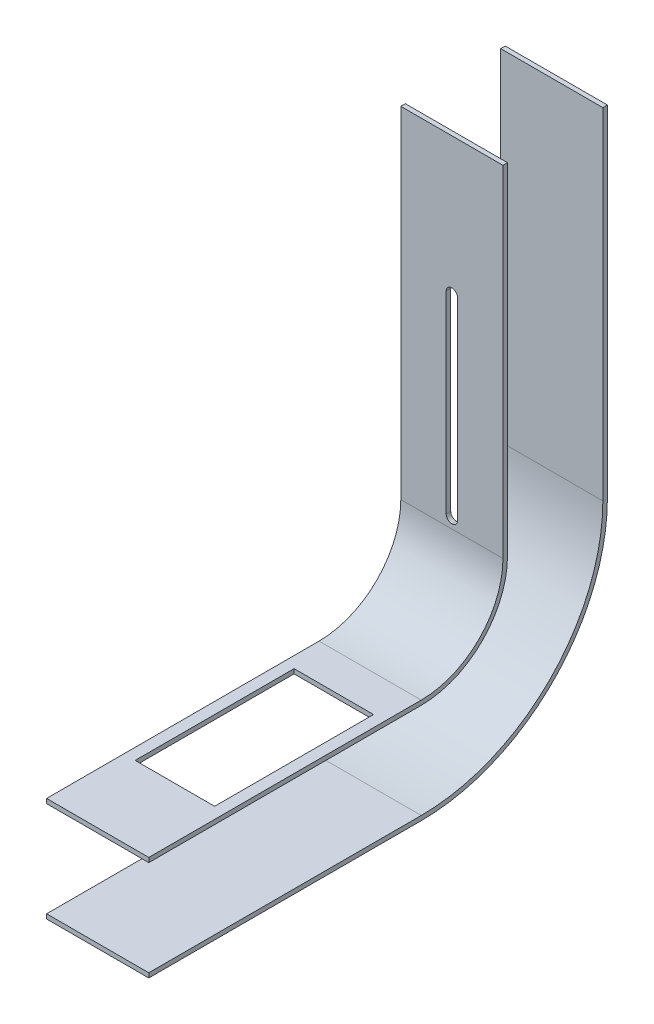
ISO-10303-21;
HEADER;
FILE_DESCRIPTION(('STEP AP214'),'2;1');
FILE_NAME('part.step','',(''),(''),'','','');
FILE_SCHEMA(('AUTOMOTIVE_DESIGN { 1 0 10303 214 1 1 1 1 }'));
ENDSEC;
DATA;
#1=APPLICATION_CONTEXT('core data for automotive mechanical design processes');
#2=APPLICATION_PROTOCOL_DEFINITION('international standard','automotive_design',2000,#1);
#3=PRODUCT_CONTEXT('',#1,'mechanical');
#4=PRODUCT('Part','Part','',(#3));
#5=PRODUCT_RELATED_PRODUCT_CATEGORY('part','',(#4));
#6=PRODUCT_DEFINITION_FORMATION('','',#4);
#7=PRODUCT_DEFINITION_CONTEXT('part definition',#1,'design');
#8=PRODUCT_DEFINITION('design','',#6,#7);
#9=PRODUCT_DEFINITION_SHAPE('','',#8);
#10=(LENGTH_UNIT() NAMED_UNIT(*) SI_UNIT(.MILLI.,.METRE.));
#11=(NAMED_UNIT(*) PLANE_ANGLE_UNIT() SI_UNIT($,.RADIAN.));
#12=(NAMED_UNIT(*) SI_UNIT($,.STERADIAN.) SOLID_ANGLE_UNIT());
#13=UNCERTAINTY_MEASURE_WITH_UNIT(LENGTH_MEASURE(1.E-05),#10,'distance_accuracy_value','');
#14=(GEOMETRIC_REPRESENTATION_CONTEXT(3) GLOBAL_UNCERTAINTY_ASSIGNED_CONTEXT((#13)) GLOBAL_UNIT_ASSIGNED_CONTEXT((#10,
#11,#12)) REPRESENTATION_CONTEXT('',''));
#15=CARTESIAN_POINT('',(0.,0.,0.));
#16=DIRECTION('',(0.,0.,1.));
#17=DIRECTION('',(1.,0.,0.));
#18=AXIS2_PLACEMENT_3D('',#15,#16,#17);
#19=CARTESIAN_POINT('',(45.,-82.,0.));
#20=DIRECTION('',(0.,1.,0.));
#21=DIRECTION('',(0.,0.,1.));
#22=AXIS2_PLACEMENT_3D('',#19,#20,#21);
#23=PLANE('',#22);
#24=DIRECTION('',(0.,0.,-1.));
#25=VECTOR('',#24,1.);
#26=CARTESIAN_POINT('',(0.,-82.,0.));
#27=LINE('',#26,#25);
#28=CARTESIAN_POINT('',(0.,-82.,120.));
#29=VERTEX_POINT('',#28);
#30=CARTESIAN_POINT('',(0.,-82.,0.));
#31=VERTEX_POINT('',#30);
#32=EDGE_CURVE('E189',#29,#31,#27,.T.);
#33=ORIENTED_EDGE('',*,*,#32,.T.);
#34=DIRECTION('',(-1.,0.,0.));
#35=VECTOR('',#34,1.);
#36=CARTESIAN_POINT('',(45.,-82.,0.));
#37=LINE('',#36,#35);
#38=CARTESIAN_POINT('',(45.,-82.,0.));
#39=VERTEX_POINT('',#38);
#40=EDGE_CURVE('E13',#39,#31,#37,.T.);
#41=ORIENTED_EDGE('',*,*,#40,.F.);
#42=DIRECTION('',(0.,0.,-1.));
#43=VECTOR('',#42,1.);
#44=CARTESIAN_POINT('',(45.,-82.,0.));
#45=LINE('',#44,#43);
#46=CARTESIAN_POINT('',(45.,-82.,120.));
#47=VERTEX_POINT('',#46);
#48=EDGE_CURVE('E207',#47,#39,#45,.T.);
#49=ORIENTED_EDGE('',*,*,#48,.F.);
#50=DIRECTION('',(-1.,0.,0.));
#51=VECTOR('',#50,1.);
#52=CARTESIAN_POINT('',(45.,-82.,120.));
#53=LINE('',#52,#51);
#54=EDGE_CURVE('E185',#47,#29,#53,.T.);
#55=ORIENTED_EDGE('',*,*,#54,.T.);
#56=EDGE_LOOP('',(#33,#41,#49,#55));
#57=FACE_BOUND('',#56,.T.);
#58=ADVANCED_FACE('F94',(#57),#23,.F.);
#59=CARTESIAN_POINT('',(45.,0.,0.));
#60=DIRECTION('',(-1.,0.,0.));
#61=DIRECTION('',(0.,0.,1.));
#62=AXIS2_PLACEMENT_3D('',#59,#60,#61);
#63=CYLINDRICAL_SURFACE('',#62,82.);
#64=CARTESIAN_POINT('',(0.,0.,0.));
#65=DIRECTION('',(1.,0.,0.));
#66=DIRECTION('',(0.,0.,-1.));
#67=AXIS2_PLACEMENT_3D('',#64,#65,#66);
#68=CIRCLE('',#67,82.);
#69=CARTESIAN_POINT('',(0.,0.,-82.));
#70=VERTEX_POINT('',#69);
#71=EDGE_CURVE('E192',#31,#70,#68,.T.);
#72=ORIENTED_EDGE('',*,*,#71,.T.);
#73=DIRECTION('',(-1.,0.,0.));
#74=VECTOR('',#73,1.);
#75=CARTESIAN_POINT('',(45.,0.,-82.));
#76=LINE('',#75,#74);
#77=CARTESIAN_POINT('',(45.,0.,-82.));
#78=VERTEX_POINT('',#77);
#79=EDGE_CURVE('E102',#78,#70,#76,.T.);
#80=ORIENTED_EDGE('',*,*,#79,.F.);
#81=CARTESIAN_POINT('',(45.,0.,0.));
#82=DIRECTION('',(1.,0.,0.));
#83=DIRECTION('',(0.,0.,-1.));
#84=AXIS2_PLACEMENT_3D('',#81,#82,#83);
#85=CIRCLE('',#84,82.);
#86=EDGE_CURVE('E149',#39,#78,#85,.T.);
#87=ORIENTED_EDGE('',*,*,#86,.F.);
#88=ORIENTED_EDGE('',*,*,#40,.T.);
#89=EDGE_LOOP('',(#72,#80,#87,#88));
#90=FACE_BOUND('',#89,.T.);
#91=ADVANCED_FACE('F237',(#90),#63,.T.);
#92=CARTESIAN_POINT('',(45.,0.,-82.));
#93=DIRECTION('',(0.,0.,1.));
#94=DIRECTION('',(1.,0.,0.));
#95=AXIS2_PLACEMENT_3D('',#92,#93,#94);
#96=PLANE('',#95);
#97=DIRECTION('',(0.,1.,0.));
#98=VECTOR('',#97,1.);
#99=CARTESIAN_POINT('',(0.,0.,-82.));
#100=LINE('',#99,#98);
#101=CARTESIAN_POINT('',(0.,150.,-82.));
#102=VERTEX_POINT('',#101);
#103=EDGE_CURVE('E194',#70,#102,#100,.T.);
#104=ORIENTED_EDGE('',*,*,#103,.T.);
#105=DIRECTION('',(-1.,0.,0.));
#106=VECTOR('',#105,1.);
#107=CARTESIAN_POINT('',(45.,150.,-82.));
#108=LINE('',#107,#106);
#109=CARTESIAN_POINT('',(45.,150.,-82.));
#110=VERTEX_POINT('',#109);
#111=EDGE_CURVE('E213',#110,#102,#108,.T.);
#112=ORIENTED_EDGE('',*,*,#111,.F.);
#113=DIRECTION('',(0.,1.,0.));
#114=VECTOR('',#113,1.);
#115=CARTESIAN_POINT('',(45.,0.,-82.));
#116=LINE('',#115,#114);
#117=EDGE_CURVE('E220',#78,#110,#116,.T.);
#118=ORIENTED_EDGE('',*,*,#117,.F.);
#119=ORIENTED_EDGE('',*,*,#79,.T.);
#120=EDGE_LOOP('',(#104,#112,#118,#119));
#121=FACE_BOUND('',#120,.T.);
#122=ADVANCED_FACE('F218',(#121),#96,.F.);
#123=CARTESIAN_POINT('',(45.,150.,0.));
#124=DIRECTION('',(0.,1.,0.));
#125=DIRECTION('',(0.,0.,1.));
#126=AXIS2_PLACEMENT_3D('',#123,#124,#125);
#127=PLANE('',#126);
#128=DIRECTION('',(0.,0.,-1.));
#129=VECTOR('',#128,1.);
#130=CARTESIAN_POINT('',(0.,150.,0.));
#131=LINE('',#130,#129);
#132=CARTESIAN_POINT('',(0.,150.,-80.));
#133=VERTEX_POINT('',#132);
#134=EDGE_CURVE('E197',#133,#102,#131,.T.);
#135=ORIENTED_EDGE('',*,*,#134,.F.);
#136=DIRECTION('',(-1.,0.,0.));
#137=VECTOR('',#136,1.);
#138=CARTESIAN_POINT('',(45.,150.,-80.));
#139=LINE('',#138,#137);
#140=CARTESIAN_POINT('',(45.,150.,-80.));
#141=VERTEX_POINT('',#140);
#142=EDGE_CURVE('E211',#141,#133,#139,.T.);
#143=ORIENTED_EDGE('',*,*,#142,.F.);
#144=DIRECTION('',(0.,0.,-1.));
#145=VECTOR('',#144,1.);
#146=CARTESIAN_POINT('',(45.,150.,0.));
#147=LINE('',#146,#145);
#148=EDGE_CURVE('E229',#141,#110,#147,.T.);
#149=ORIENTED_EDGE('',*,*,#148,.T.);
#150=ORIENTED_EDGE('',*,*,#111,.T.);
#151=EDGE_LOOP('',(#135,#143,#149,#150));
#152=FACE_BOUND('',#151,.T.);
#153=ADVANCED_FACE('F227',(#152),#127,.T.);
#154=CARTESIAN_POINT('',(45.,0.,-80.));
#155=DIRECTION('',(0.,0.,1.));
#156=DIRECTION('',(1.,0.,0.));
#157=AXIS2_PLACEMENT_3D('',#154,#155,#156);
#158=PLANE('',#157);
#159=DIRECTION('',(0.,1.,0.));
#160=VECTOR('',#159,1.);
#161=CARTESIAN_POINT('',(0.,0.,-80.));
#162=LINE('',#161,#160);
#163=CARTESIAN_POINT('',(0.,0.,-80.));
#164=VERTEX_POINT('',#163);
#165=EDGE_CURVE('E200',#164,#133,#162,.T.);
#166=ORIENTED_EDGE('',*,*,#165,.F.);
#167=DIRECTION('',(-1.,0.,0.));
#168=VECTOR('',#167,1.);
#169=CARTESIAN_POINT('',(45.,0.,-80.));
#170=LINE('',#169,#168);
#171=CARTESIAN_POINT('',(45.,0.,-80.));
#172=VERTEX_POINT('',#171);
#173=EDGE_CURVE('E174',#172,#164,#170,.T.);
#174=ORIENTED_EDGE('',*,*,#173,.F.);
#175=DIRECTION('',(0.,1.,0.));
#176=VECTOR('',#175,1.);
#177=CARTESIAN_POINT('',(45.,0.,-80.));
#178=LINE('',#177,#176);
#179=EDGE_CURVE('E181',#172,#141,#178,.T.);
#180=ORIENTED_EDGE('',*,*,#179,.T.);
#181=ORIENTED_EDGE('',*,*,#142,.T.);
#182=EDGE_LOOP('',(#166,#174,#180,#181));
#183=FACE_BOUND('',#182,.T.);
#184=ADVANCED_FACE('F247',(#183),#158,.T.);
#185=CARTESIAN_POINT('',(45.,0.,0.));
#186=DIRECTION('',(-1.,0.,0.));
#187=DIRECTION('',(0.,0.,1.));
#188=AXIS2_PLACEMENT_3D('',#185,#186,#187);
#189=CYLINDRICAL_SURFACE('',#188,80.);
#190=CARTESIAN_POINT('',(0.,0.,0.));
#191=DIRECTION('',(1.,0.,0.));
#192=DIRECTION('',(0.,0.,-1.));
#193=AXIS2_PLACEMENT_3D('',#190,#191,#192);
#194=CIRCLE('',#193,80.);
#195=CARTESIAN_POINT('',(0.,-80.,0.));
#196=VERTEX_POINT('',#195);
#197=EDGE_CURVE('E169',#196,#164,#194,.T.);
#198=ORIENTED_EDGE('',*,*,#197,.F.);
#199=DIRECTION('',(-1.,0.,0.));
#200=VECTOR('',#199,1.);
#201=CARTESIAN_POINT('',(45.,-80.,0.));
#202=LINE('',#201,#200);
#203=CARTESIAN_POINT('',(45.,-80.,0.));
#204=VERTEX_POINT('',#203);
#205=EDGE_CURVE('E164',#204,#196,#202,.T.);
#206=ORIENTED_EDGE('',*,*,#205,.F.);
#207=CARTESIAN_POINT('',(45.,0.,0.));
#208=DIRECTION('',(1.,0.,0.));
#209=DIRECTION('',(0.,0.,-1.));
#210=AXIS2_PLACEMENT_3D('',#207,#208,#209);
#211=CIRCLE('',#210,80.);
#212=EDGE_CURVE('E167',#204,#172,#211,.T.);
#213=ORIENTED_EDGE('',*,*,#212,.T.);
#214=ORIENTED_EDGE('',*,*,#173,.T.);
#215=EDGE_LOOP('',(#198,#206,#213,#214));
#216=FACE_BOUND('',#215,.T.);
#217=ADVANCED_FACE('F166',(#216),#189,.F.);
#218=CARTESIAN_POINT('',(45.,-80.,0.));
#219=DIRECTION('',(0.,1.,0.));
#220=DIRECTION('',(0.,0.,1.));
#221=AXIS2_PLACEMENT_3D('',#218,#219,#220);
#222=PLANE('',#221);
#223=DIRECTION('',(0.,0.,-1.));
#224=VECTOR('',#223,1.);
#225=CARTESIAN_POINT('',(0.,-80.,0.));
#226=LINE('',#225,#224);
#227=CARTESIAN_POINT('',(0.,-80.,120.));
#228=VERTEX_POINT('',#227);
#229=EDGE_CURVE('E204',#228,#196,#226,.T.);
#230=ORIENTED_EDGE('',*,*,#229,.F.);
#231=DIRECTION('',(-1.,0.,0.));
#232=VECTOR('',#231,1.);
#233=CARTESIAN_POINT('',(45.,-80.,120.));
#234=LINE('',#233,#232);
#235=CARTESIAN_POINT('',(45.,-80.,120.));
#236=VERTEX_POINT('',#235);
#237=EDGE_CURVE('E138',#236,#228,#234,.T.);
#238=ORIENTED_EDGE('',*,*,#237,.F.);
#239=DIRECTION('',(0.,0.,-1.));
#240=VECTOR('',#239,1.);
#241=CARTESIAN_POINT('',(45.,-80.,0.));
#242=LINE('',#241,#240);
#243=EDGE_CURVE('E178',#236,#204,#242,.T.);
#244=ORIENTED_EDGE('',*,*,#243,.T.);
#245=ORIENTED_EDGE('',*,*,#205,.T.);
#246=EDGE_LOOP('',(#230,#238,#244,#245));
#247=FACE_BOUND('',#246,.T.);
#248=ADVANCED_FACE('F183',(#247),#222,.T.);
#249=CARTESIAN_POINT('',(45.,0.,120.));
#250=DIRECTION('',(0.,0.,-1.));
#251=DIRECTION('',(-1.,0.,0.));
#252=AXIS2_PLACEMENT_3D('',#249,#250,#251);
#253=PLANE('',#252);
#254=DIRECTION('',(0.,-1.,0.));
#255=VECTOR('',#254,1.);
#256=CARTESIAN_POINT('',(0.,0.,120.));
#257=LINE('',#256,#255);
#258=EDGE_CURVE('E141',#228,#29,#257,.T.);
#259=ORIENTED_EDGE('',*,*,#258,.T.);
#260=ORIENTED_EDGE('',*,*,#54,.F.);
#261=DIRECTION('',(0.,-1.,0.));
#262=VECTOR('',#261,1.);
#263=CARTESIAN_POINT('',(45.,0.,120.));
#264=LINE('',#263,#262);
#265=EDGE_CURVE('E110',#236,#47,#264,.T.);
#266=ORIENTED_EDGE('',*,*,#265,.F.);
#267=ORIENTED_EDGE('',*,*,#237,.T.);
#268=EDGE_LOOP('',(#259,#260,#266,#267));
#269=FACE_BOUND('',#268,.T.);
#270=ADVANCED_FACE('F255',(#269),#253,.F.);
#271=CARTESIAN_POINT('',(45.,0.,0.));
#272=DIRECTION('',(1.,0.,0.));
#273=DIRECTION('',(0.,0.,-1.));
#274=AXIS2_PLACEMENT_3D('',#271,#272,#273);
#275=PLANE('',#274);
#276=ORIENTED_EDGE('',*,*,#48,.T.);
#277=ORIENTED_EDGE('',*,*,#86,.T.);
#278=ORIENTED_EDGE('',*,*,#117,.T.);
#279=ORIENTED_EDGE('',*,*,#148,.F.);
#280=ORIENTED_EDGE('',*,*,#179,.F.);
#281=ORIENTED_EDGE('',*,*,#212,.F.);
#282=ORIENTED_EDGE('',*,*,#243,.F.);
#283=ORIENTED_EDGE('',*,*,#265,.T.);
#284=EDGE_LOOP('',(#276,#277,#278,#279,#280,#281,#282,#283));
#285=FACE_BOUND('',#284,.T.);
#286=ADVANCED_FACE('F177',(#285),#275,.T.);
#287=CARTESIAN_POINT('',(0.,0.,0.));
#288=DIRECTION('',(1.,0.,0.));
#289=DIRECTION('',(0.,0.,-1.));
#290=AXIS2_PLACEMENT_3D('',#287,#288,#289);
#291=PLANE('',#290);
#292=ORIENTED_EDGE('',*,*,#32,.F.);
#293=ORIENTED_EDGE('',*,*,#258,.F.);
#294=ORIENTED_EDGE('',*,*,#229,.T.);
#295=ORIENTED_EDGE('',*,*,#197,.T.);
#296=ORIENTED_EDGE('',*,*,#165,.T.);
#297=ORIENTED_EDGE('',*,*,#134,.T.);
#298=ORIENTED_EDGE('',*,*,#103,.F.);
#299=ORIENTED_EDGE('',*,*,#71,.F.);
#300=EDGE_LOOP('',(#292,#293,#294,#295,#296,#297,#298,#299));
#301=FACE_BOUND('',#300,.T.);
#302=ADVANCED_FACE('F223',(#301),#291,.F.);
#303=CLOSED_SHELL('',(#58,#91,#122,#153,#184,#217,#248,#270,#286,#302));
#304=MANIFOLD_SOLID_BREP('B2',#303);
#305=CARTESIAN_POINT('',(45.,0.,0.));
#306=DIRECTION('',(-1.,0.,0.));
#307=DIRECTION('',(0.,0.,1.));
#308=AXIS2_PLACEMENT_3D('',#305,#306,#307);
#309=CYLINDRICAL_SURFACE('',#308,36.);
#310=CARTESIAN_POINT('',(0.,0.,0.));
#311=DIRECTION('',(1.,0.,0.));
#312=DIRECTION('',(0.,0.,-1.));
#313=AXIS2_PLACEMENT_3D('',#310,#311,#312);
#314=CIRCLE('',#313,36.);
#315=CARTESIAN_POINT('',(0.,-36.,0.));
#316=VERTEX_POINT('',#315);
#317=CARTESIAN_POINT('',(0.,0.,-36.));
#318=VERTEX_POINT('',#317);
#319=EDGE_CURVE('E495',#316,#318,#314,.T.);
#320=ORIENTED_EDGE('',*,*,#319,.F.);
#321=DIRECTION('',(-1.,0.,0.));
#322=VECTOR('',#321,1.);
#323=CARTESIAN_POINT('',(45.,-36.,0.));
#324=LINE('',#323,#322);
#325=CARTESIAN_POINT('',(45.,-36.,0.));
#326=VERTEX_POINT('',#325);
#327=EDGE_CURVE('E553',#326,#316,#324,.T.);
#328=ORIENTED_EDGE('',*,*,#327,.F.);
#329=CARTESIAN_POINT('',(45.,0.,0.));
#330=DIRECTION('',(1.,0.,0.));
#331=DIRECTION('',(0.,0.,-1.));
#332=AXIS2_PLACEMENT_3D('',#329,#330,#331);
#333=CIRCLE('',#332,36.);
#334=CARTESIAN_POINT('',(45.,0.,-36.));
#335=VERTEX_POINT('',#334);
#336=EDGE_CURVE('E496',#326,#335,#333,.T.);
#337=ORIENTED_EDGE('',*,*,#336,.T.);
#338=DIRECTION('',(-1.,0.,0.));
#339=VECTOR('',#338,1.);
#340=CARTESIAN_POINT('',(45.,0.,-36.));
#341=LINE('',#340,#339);
#342=EDGE_CURVE('E517',#335,#318,#341,.T.);
#343=ORIENTED_EDGE('',*,*,#342,.T.);
#344=EDGE_LOOP('',(#320,#328,#337,#343));
#345=FACE_BOUND('',#344,.T.);
#346=ADVANCED_FACE('F322',(#345),#309,.F.);
#347=CARTESIAN_POINT('',(45.,-36.,0.));
#348=DIRECTION('',(0.,-1.,0.));
#349=DIRECTION('',(0.,0.,-1.));
#350=AXIS2_PLACEMENT_3D('',#347,#348,#349);
#351=PLANE('',#350);
#352=DIRECTION('',(-1.,0.,0.));
#353=VECTOR('',#352,1.);
#354=CARTESIAN_POINT('',(5.,-36.,16.));
#355=LINE('',#354,#353);
#356=CARTESIAN_POINT('',(40.,-36.,16.));
#357=VERTEX_POINT('',#356);
#358=CARTESIAN_POINT('',(5.,-36.,16.));
#359=VERTEX_POINT('',#358);
#360=EDGE_CURVE('E464',#357,#359,#355,.T.);
#361=ORIENTED_EDGE('',*,*,#360,.F.);
#362=DIRECTION('',(0.,0.,-1.));
#363=VECTOR('',#362,1.);
#364=CARTESIAN_POINT('',(40.,-36.,86.));
#365=LINE('',#364,#363);
#366=CARTESIAN_POINT('',(40.,-36.,86.));
#367=VERTEX_POINT('',#366);
#368=EDGE_CURVE('E469',#367,#357,#365,.T.);
#369=ORIENTED_EDGE('',*,*,#368,.F.);
#370=DIRECTION('',(1.,0.,0.));
#371=VECTOR('',#370,1.);
#372=CARTESIAN_POINT('',(5.,-36.,86.));
#373=LINE('',#372,#371);
#374=CARTESIAN_POINT('',(5.,-36.,86.));
#375=VERTEX_POINT('',#374);
#376=EDGE_CURVE('E474',#375,#367,#373,.T.);
#377=ORIENTED_EDGE('',*,*,#376,.F.);
#378=DIRECTION('',(0.,0.,1.));
#379=VECTOR('',#378,1.);
#380=CARTESIAN_POINT('',(5.,-36.,86.));
#381=LINE('',#380,#379);
#382=EDGE_CURVE('E453',#359,#375,#381,.T.);
#383=ORIENTED_EDGE('',*,*,#382,.F.);
#384=EDGE_LOOP('',(#361,#369,#377,#383));
#385=FACE_BOUND('',#384,.T.);
#386=DIRECTION('',(0.,0.,1.));
#387=VECTOR('',#386,1.);
#388=CARTESIAN_POINT('',(0.,-36.,0.));
#389=LINE('',#388,#387);
#390=CARTESIAN_POINT('',(0.,-36.,120.));
#391=VERTEX_POINT('',#390);
#392=EDGE_CURVE('E520',#316,#391,#389,.T.);
#393=ORIENTED_EDGE('',*,*,#392,.T.);
#394=DIRECTION('',(-1.,0.,0.));
#395=VECTOR('',#394,1.);
#396=CARTESIAN_POINT('',(45.,-36.,120.));
#397=LINE('',#396,#395);
#398=CARTESIAN_POINT('',(45.,-36.,120.));
#399=VERTEX_POINT('',#398);
#400=EDGE_CURVE('E550',#399,#391,#397,.T.);
#401=ORIENTED_EDGE('',*,*,#400,.F.);
#402=DIRECTION('',(0.,0.,1.));
#403=VECTOR('',#402,1.);
#404=CARTESIAN_POINT('',(45.,-36.,0.));
#405=LINE('',#404,#403);
#406=EDGE_CURVE('E499',#326,#399,#405,.T.);
#407=ORIENTED_EDGE('',*,*,#406,.F.);
#408=ORIENTED_EDGE('',*,*,#327,.T.);
#409=EDGE_LOOP('',(#393,#401,#407,#408));
#410=FACE_BOUND('',#409,.T.);
#411=ADVANCED_FACE('F471',(#385,#410),#351,.F.);
#412=CARTESIAN_POINT('',(45.,0.,120.));
#413=DIRECTION('',(0.,0.,-1.));
#414=DIRECTION('',(-1.,0.,0.));
#415=AXIS2_PLACEMENT_3D('',#412,#413,#414);
#416=PLANE('',#415);
#417=DIRECTION('',(0.,-1.,0.));
#418=VECTOR('',#417,1.);
#419=CARTESIAN_POINT('',(0.,0.,120.));
#420=LINE('',#419,#418);
#421=CARTESIAN_POINT('',(0.,-38.,120.));
#422=VERTEX_POINT('',#421);
#423=EDGE_CURVE('E522',#391,#422,#420,.T.);
#424=ORIENTED_EDGE('',*,*,#423,.T.);
#425=DIRECTION('',(-1.,0.,0.));
#426=VECTOR('',#425,1.);
#427=CARTESIAN_POINT('',(45.,-38.,120.));
#428=LINE('',#427,#426);
#429=CARTESIAN_POINT('',(45.,-38.,120.));
#430=VERTEX_POINT('',#429);
#431=EDGE_CURVE('E548',#430,#422,#428,.T.);
#432=ORIENTED_EDGE('',*,*,#431,.F.);
#433=DIRECTION('',(0.,-1.,0.));
#434=VECTOR('',#433,1.);
#435=CARTESIAN_POINT('',(45.,0.,120.));
#436=LINE('',#435,#434);
#437=EDGE_CURVE('E502',#399,#430,#436,.T.);
#438=ORIENTED_EDGE('',*,*,#437,.F.);
#439=ORIENTED_EDGE('',*,*,#400,.T.);
#440=EDGE_LOOP('',(#424,#432,#438,#439));
#441=FACE_BOUND('',#440,.T.);
#442=ADVANCED_FACE('F641',(#441),#416,.F.);
#443=CARTESIAN_POINT('',(45.,-38.,0.));
#444=DIRECTION('',(0.,-1.,0.));
#445=DIRECTION('',(0.,0.,-1.));
#446=AXIS2_PLACEMENT_3D('',#443,#444,#445);
#447=PLANE('',#446);
#448=DIRECTION('',(0.,0.,1.));
#449=VECTOR('',#448,1.);
#450=CARTESIAN_POINT('',(40.,-38.,0.));
#451=LINE('',#450,#449);
#452=CARTESIAN_POINT('',(40.,-38.,16.));
#453=VERTEX_POINT('',#452);
#454=CARTESIAN_POINT('',(40.,-38.,86.));
#455=VERTEX_POINT('',#454);
#456=EDGE_CURVE('E560',#453,#455,#451,.T.);
#457=ORIENTED_EDGE('',*,*,#456,.F.);
#458=DIRECTION('',(1.,0.,0.));
#459=VECTOR('',#458,1.);
#460=CARTESIAN_POINT('',(45.,-38.,16.));
#461=LINE('',#460,#459);
#462=CARTESIAN_POINT('',(5.,-38.,16.));
#463=VERTEX_POINT('',#462);
#464=EDGE_CURVE('E555',#463,#453,#461,.T.);
#465=ORIENTED_EDGE('',*,*,#464,.F.);
#466=DIRECTION('',(0.,0.,-1.));
#467=VECTOR('',#466,1.);
#468=CARTESIAN_POINT('',(5.,-38.,0.));
#469=LINE('',#468,#467);
#470=CARTESIAN_POINT('',(5.,-38.,86.));
#471=VERTEX_POINT('',#470);
#472=EDGE_CURVE('E456',#471,#463,#469,.T.);
#473=ORIENTED_EDGE('',*,*,#472,.F.);
#474=DIRECTION('',(-1.,0.,0.));
#475=VECTOR('',#474,1.);
#476=CARTESIAN_POINT('',(45.,-38.,86.));
#477=LINE('',#476,#475);
#478=EDGE_CURVE('E558',#455,#471,#477,.T.);
#479=ORIENTED_EDGE('',*,*,#478,.F.);
#480=EDGE_LOOP('',(#457,#465,#473,#479));
#481=FACE_BOUND('',#480,.T.);
#482=DIRECTION('',(0.,0.,1.));
#483=VECTOR('',#482,1.);
#484=CARTESIAN_POINT('',(0.,-38.,0.));
#485=LINE('',#484,#483);
#486=CARTESIAN_POINT('',(0.,-38.,0.));
#487=VERTEX_POINT('',#486);
#488=EDGE_CURVE('E525',#487,#422,#485,.T.);
#489=ORIENTED_EDGE('',*,*,#488,.F.);
#490=DIRECTION('',(-1.,0.,0.));
#491=VECTOR('',#490,1.);
#492=CARTESIAN_POINT('',(45.,-38.,0.));
#493=LINE('',#492,#491);
#494=CARTESIAN_POINT('',(45.,-38.,0.));
#495=VERTEX_POINT('',#494);
#496=EDGE_CURVE('E546',#495,#487,#493,.T.);
#497=ORIENTED_EDGE('',*,*,#496,.F.);
#498=DIRECTION('',(0.,0.,1.));
#499=VECTOR('',#498,1.);
#500=CARTESIAN_POINT('',(45.,-38.,0.));
#501=LINE('',#500,#499);
#502=EDGE_CURVE('E504',#495,#430,#501,.T.);
#503=ORIENTED_EDGE('',*,*,#502,.T.);
#504=ORIENTED_EDGE('',*,*,#431,.T.);
#505=EDGE_LOOP('',(#489,#497,#503,#504));
#506=FACE_BOUND('',#505,.T.);
#507=ADVANCED_FACE('F637',(#481,#506),#447,.T.);
#508=CARTESIAN_POINT('',(45.,0.,0.));
#509=DIRECTION('',(-1.,0.,0.));
#510=DIRECTION('',(0.,0.,1.));
#511=AXIS2_PLACEMENT_3D('',#508,#509,#510);
#512=CYLINDRICAL_SURFACE('',#511,38.);
#513=CARTESIAN_POINT('',(0.,0.,0.));
#514=DIRECTION('',(1.,0.,0.));
#515=DIRECTION('',(0.,0.,-1.));
#516=AXIS2_PLACEMENT_3D('',#513,#514,#515);
#517=CIRCLE('',#516,38.);
#518=CARTESIAN_POINT('',(0.,0.,-38.));
#519=VERTEX_POINT('',#518);
#520=EDGE_CURVE('E528',#487,#519,#517,.T.);
#521=ORIENTED_EDGE('',*,*,#520,.T.);
#522=DIRECTION('',(-1.,0.,0.));
#523=VECTOR('',#522,1.);
#524=CARTESIAN_POINT('',(45.,0.,-38.));
#525=LINE('',#524,#523);
#526=CARTESIAN_POINT('',(45.,0.,-38.));
#527=VERTEX_POINT('',#526);
#528=EDGE_CURVE('E544',#527,#519,#525,.T.);
#529=ORIENTED_EDGE('',*,*,#528,.F.);
#530=CARTESIAN_POINT('',(45.,0.,0.));
#531=DIRECTION('',(1.,0.,0.));
#532=DIRECTION('',(0.,0.,-1.));
#533=AXIS2_PLACEMENT_3D('',#530,#531,#532);
#534=CIRCLE('',#533,38.);
#535=EDGE_CURVE('E507',#495,#527,#534,.T.);
#536=ORIENTED_EDGE('',*,*,#535,.F.);
#537=ORIENTED_EDGE('',*,*,#496,.T.);
#538=EDGE_LOOP('',(#521,#529,#536,#537));
#539=FACE_BOUND('',#538,.T.);
#540=ADVANCED_FACE('F614',(#539),#512,.T.);
#541=CARTESIAN_POINT('',(45.,0.,-38.));
#542=DIRECTION('',(0.,0.,-1.));
#543=DIRECTION('',(0.,1.,0.));
#544=AXIS2_PLACEMENT_3D('',#541,#542,#543);
#545=PLANE('',#544);
#546=CARTESIAN_POINT('',(22.5,89.5,-38.));
#547=DIRECTION('',(0.,0.,-1.));
#548=DIRECTION('',(0.,1.,0.));
#549=AXIS2_PLACEMENT_3D('',#546,#547,#548);
#550=CIRCLE('',#549,2.5);
#551=CARTESIAN_POINT('',(25.,89.5,-38.));
#552=VERTEX_POINT('',#551);
#553=CARTESIAN_POINT('',(22.5,92.,-38.));
#554=VERTEX_POINT('',#553);
#555=EDGE_CURVE('E574',#552,#554,#550,.F.);
#556=ORIENTED_EDGE('',*,*,#555,.T.);
#557=CARTESIAN_POINT('',(22.5,89.5,-38.));
#558=DIRECTION('',(0.,0.,-1.));
#559=DIRECTION('',(0.,1.,0.));
#560=AXIS2_PLACEMENT_3D('',#557,#558,#559);
#561=CIRCLE('',#560,2.5);
#562=CARTESIAN_POINT('',(20.,89.5,-38.));
#563=VERTEX_POINT('',#562);
#564=EDGE_CURVE('E578',#554,#563,#561,.F.);
#565=ORIENTED_EDGE('',*,*,#564,.T.);
#566=DIRECTION('',(0.,1.,0.));
#567=VECTOR('',#566,1.);
#568=CARTESIAN_POINT('',(20.,0.,-38.));
#569=LINE('',#568,#567);
#570=CARTESIAN_POINT('',(20.,4.50000000000001,-38.));
#571=VERTEX_POINT('',#570);
#572=EDGE_CURVE('E489',#571,#563,#569,.T.);
#573=ORIENTED_EDGE('',*,*,#572,.F.);
#574=CARTESIAN_POINT('',(22.5,4.50000000000001,-38.));
#575=DIRECTION('',(0.,0.,-1.));
#576=DIRECTION('',(0.,1.,0.));
#577=AXIS2_PLACEMENT_3D('',#574,#575,#576);
#578=CIRCLE('',#577,2.5);
#579=CARTESIAN_POINT('',(22.5,2.00000000000001,-38.));
#580=VERTEX_POINT('',#579);
#581=EDGE_CURVE('E92',#571,#580,#578,.F.);
#582=ORIENTED_EDGE('',*,*,#581,.T.);
#583=CARTESIAN_POINT('',(22.5,4.5,-38.));
#584=DIRECTION('',(0.,0.,-1.));
#585=DIRECTION('',(0.,1.,0.));
#586=AXIS2_PLACEMENT_3D('',#583,#584,#585);
#587=CIRCLE('',#586,2.5);
#588=CARTESIAN_POINT('',(25.,4.5,-38.));
#589=VERTEX_POINT('',#588);
#590=EDGE_CURVE('E581',#580,#589,#587,.F.);
#591=ORIENTED_EDGE('',*,*,#590,.T.);
#592=DIRECTION('',(0.,-1.,0.));
#593=VECTOR('',#592,1.);
#594=CARTESIAN_POINT('',(25.,0.,-38.));
#595=LINE('',#594,#593);
#596=EDGE_CURVE('E492',#552,#589,#595,.T.);
#597=ORIENTED_EDGE('',*,*,#596,.F.);
#598=EDGE_LOOP('',(#556,#565,#573,#582,#591,#597));
#599=FACE_BOUND('',#598,.T.);
#600=DIRECTION('',(0.,-1.,0.));
#601=VECTOR('',#600,1.);
#602=CARTESIAN_POINT('',(0.,0.,-38.));
#603=LINE('',#602,#601);
#604=CARTESIAN_POINT('',(0.,150.,-38.));
#605=VERTEX_POINT('',#604);
#606=EDGE_CURVE('E531',#605,#519,#603,.T.);
#607=ORIENTED_EDGE('',*,*,#606,.F.);
#608=DIRECTION('',(-1.,0.,0.));
#609=VECTOR('',#608,1.);
#610=CARTESIAN_POINT('',(45.,150.,-38.));
#611=LINE('',#610,#609);
#612=CARTESIAN_POINT('',(45.,150.,-38.));
#613=VERTEX_POINT('',#612);
#614=EDGE_CURVE('E542',#613,#605,#611,.T.);
#615=ORIENTED_EDGE('',*,*,#614,.F.);
#616=DIRECTION('',(0.,-1.,0.));
#617=VECTOR('',#616,1.);
#618=CARTESIAN_POINT('',(45.,0.,-38.));
#619=LINE('',#618,#617);
#620=EDGE_CURVE('E509',#613,#527,#619,.T.);
#621=ORIENTED_EDGE('',*,*,#620,.T.);
#622=ORIENTED_EDGE('',*,*,#528,.T.);
#623=EDGE_LOOP('',(#607,#615,#621,#622));
#624=FACE_BOUND('',#623,.T.);
#625=ADVANCED_FACE('F610',(#599,#624),#545,.T.);
#626=CARTESIAN_POINT('',(45.,150.,0.));
#627=DIRECTION('',(0.,1.,0.));
#628=DIRECTION('',(0.,0.,1.));
#629=AXIS2_PLACEMENT_3D('',#626,#627,#628);
#630=PLANE('',#629);
#631=DIRECTION('',(0.,0.,-1.));
#632=VECTOR('',#631,1.);
#633=CARTESIAN_POINT('',(0.,150.,0.));
#634=LINE('',#633,#632);
#635=CARTESIAN_POINT('',(0.,150.,-36.));
#636=VERTEX_POINT('',#635);
#637=EDGE_CURVE('E534',#636,#605,#634,.T.);
#638=ORIENTED_EDGE('',*,*,#637,.F.);
#639=DIRECTION('',(-1.,0.,0.));
#640=VECTOR('',#639,1.);
#641=CARTESIAN_POINT('',(45.,150.,-36.));
#642=LINE('',#641,#640);
#643=CARTESIAN_POINT('',(45.,150.,-36.));
#644=VERTEX_POINT('',#643);
#645=EDGE_CURVE('E540',#644,#636,#642,.T.);
#646=ORIENTED_EDGE('',*,*,#645,.F.);
#647=DIRECTION('',(0.,0.,-1.));
#648=VECTOR('',#647,1.);
#649=CARTESIAN_POINT('',(45.,150.,0.));
#650=LINE('',#649,#648);
#651=EDGE_CURVE('E512',#644,#613,#650,.T.);
#652=ORIENTED_EDGE('',*,*,#651,.T.);
#653=ORIENTED_EDGE('',*,*,#614,.T.);
#654=EDGE_LOOP('',(#638,#646,#652,#653));
#655=FACE_BOUND('',#654,.T.);
#656=ADVANCED_FACE('F613',(#655),#630,.T.);
#657=CARTESIAN_POINT('',(45.,0.,-36.));
#658=DIRECTION('',(0.,0.,-1.));
#659=DIRECTION('',(0.,1.,0.));
#660=AXIS2_PLACEMENT_3D('',#657,#658,#659);
#661=PLANE('',#660);
#662=DIRECTION('',(0.,-1.,0.));
#663=VECTOR('',#662,1.);
#664=CARTESIAN_POINT('',(20.,92.,-36.));
#665=LINE('',#664,#663);
#666=CARTESIAN_POINT('',(20.,89.5,-36.));
#667=VERTEX_POINT('',#666);
#668=CARTESIAN_POINT('',(20.,4.50000000000003,-36.));
#669=VERTEX_POINT('',#668);
#670=EDGE_CURVE('E486',#667,#669,#665,.T.);
#671=ORIENTED_EDGE('',*,*,#670,.F.);
#672=CARTESIAN_POINT('',(22.5,89.5,-36.));
#673=DIRECTION('',(0.,0.,-1.));
#674=DIRECTION('',(0.,1.,0.));
#675=AXIS2_PLACEMENT_3D('',#672,#673,#674);
#676=CIRCLE('',#675,2.5);
#677=CARTESIAN_POINT('',(22.5,92.,-36.));
#678=VERTEX_POINT('',#677);
#679=EDGE_CURVE('E576',#667,#678,#676,.T.);
#680=ORIENTED_EDGE('',*,*,#679,.T.);
#681=CARTESIAN_POINT('',(22.5,89.5,-36.));
#682=DIRECTION('',(0.,0.,-1.));
#683=DIRECTION('',(0.,1.,0.));
#684=AXIS2_PLACEMENT_3D('',#681,#682,#683);
#685=CIRCLE('',#684,2.5);
#686=CARTESIAN_POINT('',(25.,89.5,-36.));
#687=VERTEX_POINT('',#686);
#688=EDGE_CURVE('E572',#678,#687,#685,.T.);
#689=ORIENTED_EDGE('',*,*,#688,.T.);
#690=DIRECTION('',(0.,1.,0.));
#691=VECTOR('',#690,1.);
#692=CARTESIAN_POINT('',(25.,92.,-36.));
#693=LINE('',#692,#691);
#694=CARTESIAN_POINT('',(25.,4.50000000000003,-36.));
#695=VERTEX_POINT('',#694);
#696=EDGE_CURVE('E481',#695,#687,#693,.T.);
#697=ORIENTED_EDGE('',*,*,#696,.F.);
#698=CARTESIAN_POINT('',(22.5,4.5,-36.));
#699=DIRECTION('',(0.,0.,-1.));
#700=DIRECTION('',(0.,1.,0.));
#701=AXIS2_PLACEMENT_3D('',#698,#699,#700);
#702=CIRCLE('',#701,2.5);
#703=CARTESIAN_POINT('',(22.5,2.00000000000001,-36.));
#704=VERTEX_POINT('',#703);
#705=EDGE_CURVE('E345',#695,#704,#702,.T.);
#706=ORIENTED_EDGE('',*,*,#705,.T.);
#707=CARTESIAN_POINT('',(22.5,4.50000000000001,-36.));
#708=DIRECTION('',(0.,0.,-1.));
#709=DIRECTION('',(0.,1.,0.));
#710=AXIS2_PLACEMENT_3D('',#707,#708,#709);
#711=CIRCLE('',#710,2.5);
#712=EDGE_CURVE('E331',#704,#669,#711,.T.);
#713=ORIENTED_EDGE('',*,*,#712,.T.);
#714=EDGE_LOOP('',(#671,#680,#689,#697,#706,#713));
#715=FACE_BOUND('',#714,.T.);
#716=DIRECTION('',(0.,-1.,0.));
#717=VECTOR('',#716,1.);
#718=CARTESIAN_POINT('',(0.,0.,-36.));
#719=LINE('',#718,#717);
#720=EDGE_CURVE('E500',#636,#318,#719,.T.);
#721=ORIENTED_EDGE('',*,*,#720,.T.);
#722=ORIENTED_EDGE('',*,*,#342,.F.);
#723=DIRECTION('',(0.,-1.,0.));
#724=VECTOR('',#723,1.);
#725=CARTESIAN_POINT('',(45.,0.,-36.));
#726=LINE('',#725,#724);
#727=EDGE_CURVE('E515',#644,#335,#726,.T.);
#728=ORIENTED_EDGE('',*,*,#727,.F.);
#729=ORIENTED_EDGE('',*,*,#645,.T.);
#730=EDGE_LOOP('',(#721,#722,#728,#729));
#731=FACE_BOUND('',#730,.T.);
#732=ADVANCED_FACE('F596',(#715,#731),#661,.F.);
#733=CARTESIAN_POINT('',(45.,0.,0.));
#734=DIRECTION('',(1.,0.,0.));
#735=DIRECTION('',(0.,0.,-1.));
#736=AXIS2_PLACEMENT_3D('',#733,#734,#735);
#737=PLANE('',#736);
#738=ORIENTED_EDGE('',*,*,#336,.F.);
#739=ORIENTED_EDGE('',*,*,#406,.T.);
#740=ORIENTED_EDGE('',*,*,#437,.T.);
#741=ORIENTED_EDGE('',*,*,#502,.F.);
#742=ORIENTED_EDGE('',*,*,#535,.T.);
#743=ORIENTED_EDGE('',*,*,#620,.F.);
#744=ORIENTED_EDGE('',*,*,#651,.F.);
#745=ORIENTED_EDGE('',*,*,#727,.T.);
#746=EDGE_LOOP('',(#738,#739,#740,#741,#742,#743,#744,#745));
#747=FACE_BOUND('',#746,.T.);
#748=ADVANCED_FACE('F629',(#747),#737,.T.);
#749=CARTESIAN_POINT('',(0.,0.,0.));
#750=DIRECTION('',(1.,0.,0.));
#751=DIRECTION('',(0.,0.,-1.));
#752=AXIS2_PLACEMENT_3D('',#749,#750,#751);
#753=PLANE('',#752);
#754=ORIENTED_EDGE('',*,*,#319,.T.);
#755=ORIENTED_EDGE('',*,*,#720,.F.);
#756=ORIENTED_EDGE('',*,*,#637,.T.);
#757=ORIENTED_EDGE('',*,*,#606,.T.);
#758=ORIENTED_EDGE('',*,*,#520,.F.);
#759=ORIENTED_EDGE('',*,*,#488,.T.);
#760=ORIENTED_EDGE('',*,*,#423,.F.);
#761=ORIENTED_EDGE('',*,*,#392,.F.);
#762=EDGE_LOOP('',(#754,#755,#756,#757,#758,#759,#760,#761));
#763=FACE_BOUND('',#762,.T.);
#764=ADVANCED_FACE('F623',(#763),#753,.F.);
#765=CARTESIAN_POINT('',(25.,92.,-41.));
#766=DIRECTION('',(1.,0.,0.));
#767=DIRECTION('',(0.,1.,0.));
#768=AXIS2_PLACEMENT_3D('',#765,#766,#767);
#769=PLANE('',#768);
#770=ORIENTED_EDGE('',*,*,#696,.T.);
#771=DIRECTION('',(0.,0.,1.));
#772=VECTOR('',#771,1.);
#773=CARTESIAN_POINT('',(25.,89.5,-38.));
#774=LINE('',#773,#772);
#775=EDGE_CURVE('E565',#687,#552,#774,.F.);
#776=ORIENTED_EDGE('',*,*,#775,.T.);
#777=ORIENTED_EDGE('',*,*,#596,.T.);
#778=DIRECTION('',(0.,0.,1.));
#779=VECTOR('',#778,1.);
#780=CARTESIAN_POINT('',(25.,4.5,-36.));
#781=LINE('',#780,#779);
#782=EDGE_CURVE('E562',#589,#695,#781,.T.);
#783=ORIENTED_EDGE('',*,*,#782,.T.);
#784=EDGE_LOOP('',(#770,#776,#777,#783));
#785=FACE_BOUND('',#784,.T.);
#786=ADVANCED_FACE('F607',(#785),#769,.F.);
#787=CARTESIAN_POINT('',(20.,92.,-41.));
#788=DIRECTION('',(-1.,0.,0.));
#789=DIRECTION('',(0.,-1.,0.));
#790=AXIS2_PLACEMENT_3D('',#787,#788,#789);
#791=PLANE('',#790);
#792=ORIENTED_EDGE('',*,*,#572,.T.);
#793=DIRECTION('',(0.,0.,1.));
#794=VECTOR('',#793,1.);
#795=CARTESIAN_POINT('',(20.,89.5,-36.));
#796=LINE('',#795,#794);
#797=EDGE_CURVE('E570',#563,#667,#796,.T.);
#798=ORIENTED_EDGE('',*,*,#797,.T.);
#799=ORIENTED_EDGE('',*,*,#670,.T.);
#800=DIRECTION('',(0.,0.,1.));
#801=VECTOR('',#800,1.);
#802=CARTESIAN_POINT('',(20.,4.50000000000001,-38.));
#803=LINE('',#802,#801);
#804=EDGE_CURVE('E568',#669,#571,#803,.F.);
#805=ORIENTED_EDGE('',*,*,#804,.T.);
#806=EDGE_LOOP('',(#792,#798,#799,#805));
#807=FACE_BOUND('',#806,.T.);
#808=ADVANCED_FACE('F600',(#807),#791,.F.);
#809=CARTESIAN_POINT('',(40.,-41.,86.));
#810=DIRECTION('',(1.,0.,0.));
#811=DIRECTION('',(0.,0.,-1.));
#812=AXIS2_PLACEMENT_3D('',#809,#810,#811);
#813=PLANE('',#812);
#814=ORIENTED_EDGE('',*,*,#456,.T.);
#815=DIRECTION('',(0.,1.,0.));
#816=VECTOR('',#815,1.);
#817=CARTESIAN_POINT('',(40.,-41.,86.));
#818=LINE('',#817,#816);
#819=EDGE_CURVE('E479',#455,#367,#818,.T.);
#820=ORIENTED_EDGE('',*,*,#819,.T.);
#821=ORIENTED_EDGE('',*,*,#368,.T.);
#822=DIRECTION('',(0.,1.,0.));
#823=VECTOR('',#822,1.);
#824=CARTESIAN_POINT('',(40.,-41.,16.));
#825=LINE('',#824,#823);
#826=EDGE_CURVE('E460',#453,#357,#825,.T.);
#827=ORIENTED_EDGE('',*,*,#826,.F.);
#828=EDGE_LOOP('',(#814,#820,#821,#827));
#829=FACE_BOUND('',#828,.T.);
#830=ADVANCED_FACE('F702',(#829),#813,.F.);
#831=CARTESIAN_POINT('',(5.,-41.,86.));
#832=DIRECTION('',(0.,0.,1.));
#833=DIRECTION('',(1.,0.,0.));
#834=AXIS2_PLACEMENT_3D('',#831,#832,#833);
#835=PLANE('',#834);
#836=ORIENTED_EDGE('',*,*,#478,.T.);
#837=DIRECTION('',(0.,1.,0.));
#838=VECTOR('',#837,1.);
#839=CARTESIAN_POINT('',(5.,-41.,86.));
#840=LINE('',#839,#838);
#841=EDGE_CURVE('E459',#471,#375,#840,.T.);
#842=ORIENTED_EDGE('',*,*,#841,.T.);
#843=ORIENTED_EDGE('',*,*,#376,.T.);
#844=ORIENTED_EDGE('',*,*,#819,.F.);
#845=EDGE_LOOP('',(#836,#842,#843,#844));
#846=FACE_BOUND('',#845,.T.);
#847=ADVANCED_FACE('F695',(#846),#835,.F.);
#848=CARTESIAN_POINT('',(5.,-41.,86.));
#849=DIRECTION('',(-1.,0.,0.));
#850=DIRECTION('',(0.,0.,1.));
#851=AXIS2_PLACEMENT_3D('',#848,#849,#850);
#852=PLANE('',#851);
#853=ORIENTED_EDGE('',*,*,#472,.T.);
#854=DIRECTION('',(0.,1.,0.));
#855=VECTOR('',#854,1.);
#856=CARTESIAN_POINT('',(5.,-41.,16.));
#857=LINE('',#856,#855);
#858=EDGE_CURVE('E448',#463,#359,#857,.T.);
#859=ORIENTED_EDGE('',*,*,#858,.T.);
#860=ORIENTED_EDGE('',*,*,#382,.T.);
#861=ORIENTED_EDGE('',*,*,#841,.F.);
#862=EDGE_LOOP('',(#853,#859,#860,#861));
#863=FACE_BOUND('',#862,.T.);
#864=ADVANCED_FACE('F450',(#863),#852,.F.);
#865=CARTESIAN_POINT('',(5.,-41.,16.));
#866=DIRECTION('',(0.,0.,-1.));
#867=DIRECTION('',(-1.,0.,0.));
#868=AXIS2_PLACEMENT_3D('',#865,#866,#867);
#869=PLANE('',#868);
#870=ORIENTED_EDGE('',*,*,#464,.T.);
#871=ORIENTED_EDGE('',*,*,#826,.T.);
#872=ORIENTED_EDGE('',*,*,#360,.T.);
#873=ORIENTED_EDGE('',*,*,#858,.F.);
#874=EDGE_LOOP('',(#870,#871,#872,#873));
#875=FACE_BOUND('',#874,.T.);
#876=ADVANCED_FACE('F465',(#875),#869,.F.);
#877=CARTESIAN_POINT('',(22.5,89.5,-41.));
#878=DIRECTION('',(0.,0.,-1.));
#879=DIRECTION('',(-1.,0.,0.));
#880=AXIS2_PLACEMENT_3D('',#877,#878,#879);
#881=CYLINDRICAL_SURFACE('',#880,2.5);
#882=ORIENTED_EDGE('',*,*,#797,.F.);
#883=ORIENTED_EDGE('',*,*,#564,.F.);
#884=DIRECTION('',(0.,0.,1.));
#885=VECTOR('',#884,1.);
#886=CARTESIAN_POINT('',(22.5,92.,-38.));
#887=LINE('',#886,#885);
#888=EDGE_CURVE('E583',#678,#554,#887,.F.);
#889=ORIENTED_EDGE('',*,*,#888,.F.);
#890=ORIENTED_EDGE('',*,*,#679,.F.);
#891=EDGE_LOOP('',(#882,#883,#889,#890));
#892=FACE_BOUND('',#891,.T.);
#893=ADVANCED_FACE('F604',(#892),#881,.F.);
#894=CARTESIAN_POINT('',(22.5,89.5,-41.));
#895=DIRECTION('',(0.,0.,-1.));
#896=DIRECTION('',(-1.,0.,0.));
#897=AXIS2_PLACEMENT_3D('',#894,#895,#896);
#898=CYLINDRICAL_SURFACE('',#897,2.5);
#899=ORIENTED_EDGE('',*,*,#555,.F.);
#900=ORIENTED_EDGE('',*,*,#775,.F.);
#901=ORIENTED_EDGE('',*,*,#688,.F.);
#902=ORIENTED_EDGE('',*,*,#888,.T.);
#903=EDGE_LOOP('',(#899,#900,#901,#902));
#904=FACE_BOUND('',#903,.T.);
#905=ADVANCED_FACE('F609',(#904),#898,.F.);
#906=CARTESIAN_POINT('',(22.5,4.50000000000001,-41.));
#907=DIRECTION('',(0.,0.,-1.));
#908=DIRECTION('',(-1.,0.,0.));
#909=AXIS2_PLACEMENT_3D('',#906,#907,#908);
#910=CYLINDRICAL_SURFACE('',#909,2.5);
#911=DIRECTION('',(0.,0.,1.));
#912=VECTOR('',#911,1.);
#913=CARTESIAN_POINT('',(22.5,2.00000000000001,-36.));
#914=LINE('',#913,#912);
#915=EDGE_CURVE('E326',#580,#704,#914,.T.);
#916=ORIENTED_EDGE('',*,*,#915,.F.);
#917=ORIENTED_EDGE('',*,*,#581,.F.);
#918=ORIENTED_EDGE('',*,*,#804,.F.);
#919=ORIENTED_EDGE('',*,*,#712,.F.);
#920=EDGE_LOOP('',(#916,#917,#918,#919));
#921=FACE_BOUND('',#920,.T.);
#922=ADVANCED_FACE('F324',(#921),#910,.F.);
#923=CARTESIAN_POINT('',(22.5,4.5,-41.));
#924=DIRECTION('',(0.,0.,-1.));
#925=DIRECTION('',(-1.,0.,0.));
#926=AXIS2_PLACEMENT_3D('',#923,#924,#925);
#927=CYLINDRICAL_SURFACE('',#926,2.5);
#928=ORIENTED_EDGE('',*,*,#590,.F.);
#929=ORIENTED_EDGE('',*,*,#915,.T.);
#930=ORIENTED_EDGE('',*,*,#705,.F.);
#931=ORIENTED_EDGE('',*,*,#782,.F.);
#932=EDGE_LOOP('',(#928,#929,#930,#931));
#933=FACE_BOUND('',#932,.T.);
#934=ADVANCED_FACE('F591',(#933),#927,.F.);
#935=CLOSED_SHELL('',(#346,#411,#442,#507,#540,#625,#656,#732,#748,#764,#786,#808,#830,#847,
#864,#876,#893,#905,#922,#934));
#936=MANIFOLD_SOLID_BREP('B7_NOT_SHOWN',#935);
#937=ADVANCED_BREP_SHAPE_REPRESENTATION('',(#18,#304,#936),#14);
#938=SHAPE_DEFINITION_REPRESENTATION(#9,#937);
ENDSEC;
END-ISO-10303-21;
